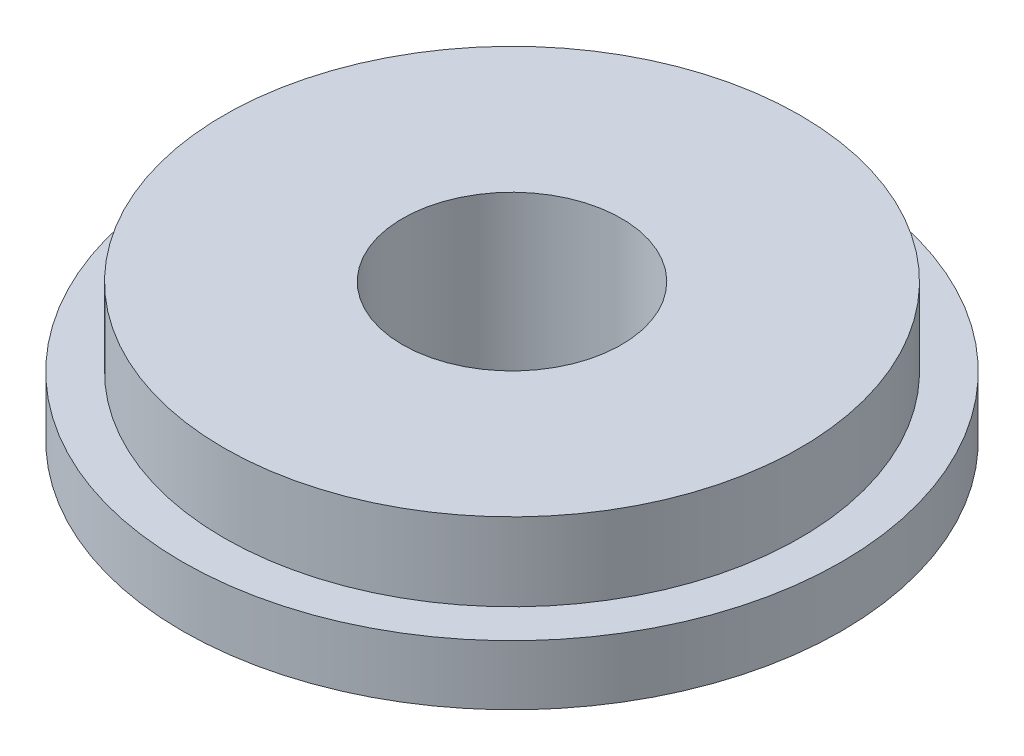
ISO-10303-21;
HEADER;
FILE_DESCRIPTION(('STEP AP214'),'2;1');
FILE_NAME('part.step','',(''),(''),'','','');
FILE_SCHEMA(('AUTOMOTIVE_DESIGN { 1 0 10303 214 1 1 1 1 }'));
ENDSEC;
DATA;
#1=APPLICATION_CONTEXT('core data for automotive mechanical design processes');
#2=APPLICATION_PROTOCOL_DEFINITION('international standard','automotive_design',2000,#1);
#3=PRODUCT_CONTEXT('',#1,'mechanical');
#4=PRODUCT('Part','Part','',(#3));
#5=PRODUCT_RELATED_PRODUCT_CATEGORY('part','',(#4));
#6=PRODUCT_DEFINITION_FORMATION('','',#4);
#7=PRODUCT_DEFINITION_CONTEXT('part definition',#1,'design');
#8=PRODUCT_DEFINITION('design','',#6,#7);
#9=PRODUCT_DEFINITION_SHAPE('','',#8);
#10=(LENGTH_UNIT() NAMED_UNIT(*) SI_UNIT(.MILLI.,.METRE.));
#11=(NAMED_UNIT(*) PLANE_ANGLE_UNIT() SI_UNIT($,.RADIAN.));
#12=(NAMED_UNIT(*) SI_UNIT($,.STERADIAN.) SOLID_ANGLE_UNIT());
#13=UNCERTAINTY_MEASURE_WITH_UNIT(LENGTH_MEASURE(1.E-05),#10,'distance_accuracy_value','');
#14=(GEOMETRIC_REPRESENTATION_CONTEXT(3) GLOBAL_UNCERTAINTY_ASSIGNED_CONTEXT((#13)) GLOBAL_UNIT_ASSIGNED_CONTEXT((#10,
#11,#12)) REPRESENTATION_CONTEXT('',''));
#15=CARTESIAN_POINT('',(0.,0.,0.));
#16=DIRECTION('',(0.,0.,1.));
#17=DIRECTION('',(1.,0.,0.));
#18=AXIS2_PLACEMENT_3D('',#15,#16,#17);
#19=CARTESIAN_POINT('',(-6.66133814775094E-13,8.9999999999999,2.22044604925031E-13));
#20=DIRECTION('',(0.,0.999999999999999,0.));
#21=DIRECTION('',(0.,0.,0.999999999999998));
#22=AXIS2_PLACEMENT_3D('',#19,#20,#21);
#23=PLANE('',#22);
#24=CARTESIAN_POINT('',(-6.66133814775094E-13,8.9999999999999,2.22044604925031E-13));
#25=DIRECTION('',(0.,0.999999999999999,0.));
#26=DIRECTION('',(0.,0.,0.999999999999998));
#27=AXIS2_PLACEMENT_3D('',#24,#25,#26);
#28=CIRCLE('',#27,4.2164);
#29=CARTESIAN_POINT('',(-6.66367871993145E-13,8.9999999999999,4.21640000000021));
#30=VERTEX_POINT('',#29);
#31=EDGE_CURVE('E12',#30,#30,#28,.F.);
#32=ORIENTED_EDGE('',*,*,#31,.T.);
#33=EDGE_LOOP('',(#32));
#34=FACE_BOUND('',#33,.T.);
#35=CARTESIAN_POINT('',(-6.66133814775094E-13,8.9999999999999,2.22044604925031E-13));
#36=DIRECTION('',(0.,0.999999999999999,0.));
#37=DIRECTION('',(0.,0.,0.999999999999998));
#38=AXIS2_PLACEMENT_3D('',#35,#36,#37);
#39=CIRCLE('',#38,11.1);
#40=CARTESIAN_POINT('',(-6.66749988553761E-13,8.9999999999999,11.1000000000002));
#41=VERTEX_POINT('',#40);
#42=EDGE_CURVE('E517',#41,#41,#39,.T.);
#43=ORIENTED_EDGE('',*,*,#42,.T.);
#44=EDGE_LOOP('',(#43));
#45=FACE_BOUND('',#44,.T.);
#46=ADVANCED_FACE('F496',(#34,#45),#23,.T.);
#47=CARTESIAN_POINT('',(-6.66133814775094E-13,8.9999999999999,2.22044604925031E-13));
#48=DIRECTION('',(0.,-0.999999999999999,0.));
#49=DIRECTION('',(0.,0.,-0.999999999999998));
#50=AXIS2_PLACEMENT_3D('',#47,#48,#49);
#51=CYLINDRICAL_SURFACE('',#50,12.7);
#52=CARTESIAN_POINT('',(4.44089209850063E-13,3.69504172281332,4.44089209850063E-13));
#53=DIRECTION('',(0.,0.999999999999999,0.));
#54=DIRECTION('',(0.,0.,0.999999999999998));
#55=AXIS2_PLACEMENT_3D('',#52,#53,#54);
#56=CIRCLE('',#55,12.7);
#57=CARTESIAN_POINT('',(4.43384218229426E-13,3.69504172281332,12.7000000000004));
#58=VERTEX_POINT('',#57);
#59=EDGE_CURVE('E522',#58,#58,#56,.T.);
#60=ORIENTED_EDGE('',*,*,#59,.T.);
#61=EDGE_LOOP('',(#60));
#62=FACE_BOUND('',#61,.T.);
#63=CARTESIAN_POINT('',(2.22044604925031E-13,5.99999999999978,4.44089209850063E-13));
#64=DIRECTION('',(0.,0.999999999999999,0.));
#65=DIRECTION('',(0.,0.,0.999999999999998));
#66=AXIS2_PLACEMENT_3D('',#63,#64,#65);
#67=CIRCLE('',#66,12.7);
#68=CARTESIAN_POINT('',(2.21339613304394E-13,5.99999999999978,12.7000000000004));
#69=VERTEX_POINT('',#68);
#70=EDGE_CURVE('E509',#69,#69,#67,.T.);
#71=ORIENTED_EDGE('',*,*,#70,.F.);
#72=EDGE_LOOP('',(#71));
#73=FACE_BOUND('',#72,.T.);
#74=ADVANCED_FACE('F498',(#62,#73),#51,.T.);
#75=CARTESIAN_POINT('',(0.,0.,0.));
#76=DIRECTION('',(0.,0.999999999999999,0.));
#77=DIRECTION('',(0.,0.,0.999999999999998));
#78=AXIS2_PLACEMENT_3D('',#75,#76,#77);
#79=PLANE('',#78);
#80=CARTESIAN_POINT('',(0.,0.,0.));
#81=DIRECTION('',(0.,0.999999999999999,0.));
#82=DIRECTION('',(0.,0.,0.999999999999998));
#83=AXIS2_PLACEMENT_3D('',#80,#81,#82);
#84=CIRCLE('',#83,6.3);
#85=CARTESIAN_POINT('',(0.,0.,6.29999999999999));
#86=VERTEX_POINT('',#85);
#87=EDGE_CURVE('E500',#86,#86,#84,.F.);
#88=ORIENTED_EDGE('',*,*,#87,.T.);
#89=EDGE_LOOP('',(#88));
#90=FACE_BOUND('',#89,.T.);
#91=CARTESIAN_POINT('',(0.,0.,0.));
#92=DIRECTION('',(0.,0.999999999999999,0.));
#93=DIRECTION('',(0.,0.,0.999999999999998));
#94=AXIS2_PLACEMENT_3D('',#91,#92,#93);
#95=CIRCLE('',#94,4.2164);
#96=CARTESIAN_POINT('',(0.,0.,4.21639999999999));
#97=VERTEX_POINT('',#96);
#98=EDGE_CURVE('E504',#97,#97,#95,.T.);
#99=ORIENTED_EDGE('',*,*,#98,.T.);
#100=EDGE_LOOP('',(#99));
#101=FACE_BOUND('',#100,.T.);
#102=ADVANCED_FACE('F530',(#90,#101),#79,.F.);
#103=CARTESIAN_POINT('',(0.,25.3999999999998,0.));
#104=DIRECTION('',(0.,-0.999999999999999,0.));
#105=DIRECTION('',(0.,0.,-0.999999999999998));
#106=AXIS2_PLACEMENT_3D('',#103,#104,#105);
#107=CYLINDRICAL_SURFACE('',#106,4.2164);
#108=ORIENTED_EDGE('',*,*,#31,.F.);
#109=EDGE_LOOP('',(#108));
#110=FACE_BOUND('',#109,.T.);
#111=ORIENTED_EDGE('',*,*,#98,.F.);
#112=EDGE_LOOP('',(#111));
#113=FACE_BOUND('',#112,.T.);
#114=ADVANCED_FACE('F550',(#110,#113),#107,.F.);
#115=CARTESIAN_POINT('',(2.22044604925031E-13,5.99999999999978,4.44089209850063E-13));
#116=DIRECTION('',(0.,0.999999999999999,0.));
#117=DIRECTION('',(0.,0.,0.999999999999998));
#118=AXIS2_PLACEMENT_3D('',#115,#116,#117);
#119=PLANE('',#118);
#120=CARTESIAN_POINT('',(2.22044604925031E-13,5.99999999999978,4.44089209850063E-13));
#121=DIRECTION('',(0.,0.999999999999999,0.));
#122=DIRECTION('',(0.,0.,0.999999999999998));
#123=AXIS2_PLACEMENT_3D('',#120,#121,#122);
#124=CIRCLE('',#123,11.1);
#125=CARTESIAN_POINT('',(2.21428431146364E-13,5.99999999999978,11.1000000000004));
#126=VERTEX_POINT('',#125);
#127=EDGE_CURVE('E513',#126,#126,#124,.T.);
#128=ORIENTED_EDGE('',*,*,#127,.F.);
#129=EDGE_LOOP('',(#128));
#130=FACE_BOUND('',#129,.T.);
#131=ORIENTED_EDGE('',*,*,#70,.T.);
#132=EDGE_LOOP('',(#131));
#133=FACE_BOUND('',#132,.T.);
#134=ADVANCED_FACE('F541',(#130,#133),#119,.T.);
#135=CARTESIAN_POINT('',(2.22044604925031E-13,5.99999999999978,4.44089209850063E-13));
#136=DIRECTION('',(0.,0.999999999999999,0.));
#137=DIRECTION('',(0.,0.,0.999999999999998));
#138=AXIS2_PLACEMENT_3D('',#135,#136,#137);
#139=CYLINDRICAL_SURFACE('',#138,11.1);
#140=ORIENTED_EDGE('',*,*,#127,.T.);
#141=EDGE_LOOP('',(#140));
#142=FACE_BOUND('',#141,.T.);
#143=ORIENTED_EDGE('',*,*,#42,.F.);
#144=EDGE_LOOP('',(#143));
#145=FACE_BOUND('',#144,.T.);
#146=ADVANCED_FACE('F536',(#142,#145),#139,.T.);
#147=CARTESIAN_POINT('',(8.88178419700125E-13,-3.00000000000011,2.22044604925031E-13));
#148=DIRECTION('',(0.,0.999999999999999,0.));
#149=DIRECTION('',(0.,0.,0.999999999999998));
#150=AXIS2_PLACEMENT_3D('',#147,#148,#149);
#151=CONICAL_SURFACE('',#150,1.1038475772933,1.0471975511966);
#152=ORIENTED_EDGE('',*,*,#87,.F.);
#153=EDGE_LOOP('',(#152));
#154=FACE_BOUND('',#153,.T.);
#155=ORIENTED_EDGE('',*,*,#59,.F.);
#156=EDGE_LOOP('',(#155));
#157=FACE_BOUND('',#156,.T.);
#158=ADVANCED_FACE('F533',(#154,#157),#151,.T.);
#159=CLOSED_SHELL('',(#46,#74,#102,#114,#134,#146,#158));
#160=MANIFOLD_SOLID_BREP('B2',#159);
#161=ADVANCED_BREP_SHAPE_REPRESENTATION('',(#18,#160),#14);
#162=SHAPE_DEFINITION_REPRESENTATION(#9,#161);
ENDSEC;
END-ISO-10303-21;
